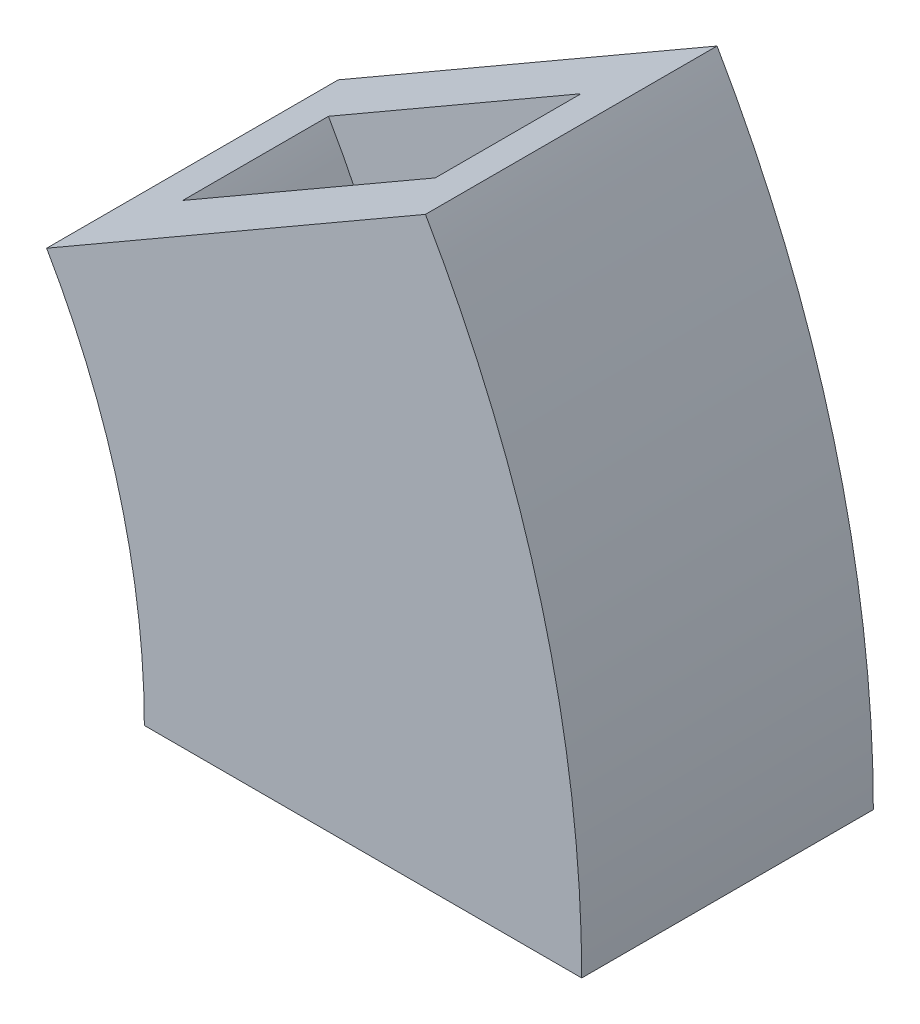
ISO-10303-21;
HEADER;
FILE_DESCRIPTION(('STEP AP214'),'2;1');
FILE_NAME('part.step','',(''),(''),'','','');
FILE_SCHEMA(('AUTOMOTIVE_DESIGN { 1 0 10303 214 1 1 1 1 }'));
ENDSEC;
DATA;
#1=APPLICATION_CONTEXT('core data for automotive mechanical design processes');
#2=APPLICATION_PROTOCOL_DEFINITION('international standard','automotive_design',2000,#1);
#3=PRODUCT_CONTEXT('',#1,'mechanical');
#4=PRODUCT('Part','Part','',(#3));
#5=PRODUCT_RELATED_PRODUCT_CATEGORY('part','',(#4));
#6=PRODUCT_DEFINITION_FORMATION('','',#4);
#7=PRODUCT_DEFINITION_CONTEXT('part definition',#1,'design');
#8=PRODUCT_DEFINITION('design','',#6,#7);
#9=PRODUCT_DEFINITION_SHAPE('','',#8);
#10=(LENGTH_UNIT() NAMED_UNIT(*) SI_UNIT(.MILLI.,.METRE.));
#11=(NAMED_UNIT(*) PLANE_ANGLE_UNIT() SI_UNIT($,.RADIAN.));
#12=(NAMED_UNIT(*) SI_UNIT($,.STERADIAN.) SOLID_ANGLE_UNIT());
#13=UNCERTAINTY_MEASURE_WITH_UNIT(LENGTH_MEASURE(1.E-05),#10,'distance_accuracy_value','');
#14=(GEOMETRIC_REPRESENTATION_CONTEXT(3) GLOBAL_UNCERTAINTY_ASSIGNED_CONTEXT((#13)) GLOBAL_UNIT_ASSIGNED_CONTEXT((#10,
#11,#12)) REPRESENTATION_CONTEXT('',''));
#15=CARTESIAN_POINT('',(0.,0.,0.));
#16=DIRECTION('',(0.,0.,1.));
#17=DIRECTION('',(1.,0.,0.));
#18=AXIS2_PLACEMENT_3D('',#15,#16,#17);
#19=CARTESIAN_POINT('',(-7.23758779701685,15.2483556476354,10.));
#20=DIRECTION('',(0.,0.,-1.));
#21=DIRECTION('',(-1.,0.,0.));
#22=AXIS2_PLACEMENT_3D('',#19,#20,#21);
#23=PLANE('',#22);
#24=CARTESIAN_POINT('',(-7.23758779701539,15.2483556476357,10.));
#25=DIRECTION('',(0.,0.,1.));
#26=DIRECTION('',(1.,0.,0.));
#27=AXIS2_PLACEMENT_3D('',#24,#25,#26);
#28=CIRCLE('',#27,75.);
#29=CARTESIAN_POINT('',(67.7624122029846,15.2483556476357,10.));
#30=VERTEX_POINT('',#29);
#31=CARTESIAN_POINT('',(57.7143174868177,52.7483556476354,10.));
#32=VERTEX_POINT('',#31);
#33=EDGE_CURVE('E57',#30,#32,#28,.T.);
#34=ORIENTED_EDGE('',*,*,#33,.F.);
#35=DIRECTION('',(1.,0.,0.));
#36=VECTOR('',#35,1.);
#37=CARTESIAN_POINT('',(42.7624122029846,15.2483556476357,10.));
#38=LINE('',#37,#36);
#39=CARTESIAN_POINT('',(47.7624122029846,15.2483556476357,10.));
#40=VERTEX_POINT('',#39);
#41=EDGE_CURVE('E164',#40,#30,#38,.T.);
#42=ORIENTED_EDGE('',*,*,#41,.F.);
#43=CARTESIAN_POINT('',(-7.23758779701539,15.2483556476357,10.));
#44=DIRECTION('',(0.,0.,1.));
#45=DIRECTION('',(1.,0.,0.));
#46=AXIS2_PLACEMENT_3D('',#43,#44,#45);
#47=CIRCLE('',#46,55.);
#48=CARTESIAN_POINT('',(40.3938094111289,42.7483556476355,10.));
#49=VERTEX_POINT('',#48);
#50=EDGE_CURVE('E65',#40,#49,#47,.T.);
#51=ORIENTED_EDGE('',*,*,#50,.T.);
#52=DIRECTION('',(-0.866025403784441,-0.499999999999995,0.));
#53=VECTOR('',#52,1.);
#54=CARTESIAN_POINT('',(36.0636823922067,40.2483556476355,10.));
#55=LINE('',#54,#53);
#56=EDGE_CURVE('E168',#32,#49,#55,.T.);
#57=ORIENTED_EDGE('',*,*,#56,.F.);
#58=EDGE_LOOP('',(#34,#42,#51,#57));
#59=FACE_BOUND('',#58,.T.);
#60=ADVANCED_FACE('F41',(#59),#23,.T.);
#61=CARTESIAN_POINT('',(0.,15.2483556476357,10.));
#62=DIRECTION('',(0.,1.,0.));
#63=DIRECTION('',(0.,0.,1.));
#64=AXIS2_PLACEMENT_3D('',#61,#62,#63);
#65=PLANE('',#64);
#66=DIRECTION('',(-1.,0.,0.));
#67=VECTOR('',#66,1.);
#68=CARTESIAN_POINT('',(42.7624122029846,15.2483556476354,0.));
#69=LINE('',#68,#67);
#70=CARTESIAN_POINT('',(67.7624122029846,15.2483556476357,0.));
#71=VERTEX_POINT('',#70);
#72=CARTESIAN_POINT('',(47.7624122029846,15.2483556476357,0.));
#73=VERTEX_POINT('',#72);
#74=EDGE_CURVE('E138',#71,#73,#69,.T.);
#75=ORIENTED_EDGE('',*,*,#74,.T.);
#76=DIRECTION('',(0.,0.,-1.));
#77=VECTOR('',#76,1.);
#78=CARTESIAN_POINT('',(47.7624122029846,15.2483556476357,10.));
#79=LINE('',#78,#77);
#80=EDGE_CURVE('E11',#40,#73,#79,.T.);
#81=ORIENTED_EDGE('',*,*,#80,.F.);
#82=ORIENTED_EDGE('',*,*,#41,.T.);
#83=DIRECTION('',(0.,0.,-1.));
#84=VECTOR('',#83,1.);
#85=CARTESIAN_POINT('',(67.7624122029846,15.2483556476357,10.));
#86=LINE('',#85,#84);
#87=EDGE_CURVE('E154',#30,#71,#86,.T.);
#88=ORIENTED_EDGE('',*,*,#87,.T.);
#89=EDGE_LOOP('',(#75,#81,#82,#88));
#90=FACE_BOUND('',#89,.T.);
#91=DIRECTION('',(0.,0.,-1.));
#92=VECTOR('',#91,1.);
#93=CARTESIAN_POINT('',(42.7624122029846,15.2483556476357,10.));
#94=LINE('',#93,#92);
#95=CARTESIAN_POINT('',(42.7624122029846,15.2483556476357,15.));
#96=VERTEX_POINT('',#95);
#97=CARTESIAN_POINT('',(42.7624122029846,15.2483556476354,-5.));
#98=VERTEX_POINT('',#97);
#99=EDGE_CURVE('E120',#96,#98,#94,.T.);
#100=ORIENTED_EDGE('',*,*,#99,.T.);
#101=DIRECTION('',(-1.,0.,0.));
#102=VECTOR('',#101,1.);
#103=CARTESIAN_POINT('',(42.7624122029846,15.2483556476354,-5.));
#104=LINE('',#103,#102);
#105=CARTESIAN_POINT('',(72.7624122029846,15.2483556476357,-5.));
#106=VERTEX_POINT('',#105);
#107=EDGE_CURVE('E136',#106,#98,#104,.T.);
#108=ORIENTED_EDGE('',*,*,#107,.F.);
#109=DIRECTION('',(0.,0.,-1.));
#110=VECTOR('',#109,1.);
#111=CARTESIAN_POINT('',(72.7624122029846,15.2483556476358,15.));
#112=LINE('',#111,#110);
#113=CARTESIAN_POINT('',(72.7624122029846,15.2483556476358,15.));
#114=VERTEX_POINT('',#113);
#115=EDGE_CURVE('E183',#114,#106,#112,.T.);
#116=ORIENTED_EDGE('',*,*,#115,.F.);
#117=DIRECTION('',(1.,0.,0.));
#118=VECTOR('',#117,1.);
#119=CARTESIAN_POINT('',(42.7624122029846,15.2483556476357,15.));
#120=LINE('',#119,#118);
#121=EDGE_CURVE('E167',#96,#114,#120,.T.);
#122=ORIENTED_EDGE('',*,*,#121,.F.);
#123=EDGE_LOOP('',(#100,#108,#116,#122));
#124=FACE_BOUND('',#123,.T.);
#125=ADVANCED_FACE('F43',(#90,#124),#65,.F.);
#126=CARTESIAN_POINT('',(-7.23758779701539,15.2483556476357,10.));
#127=DIRECTION('',(0.,0.,-1.));
#128=DIRECTION('',(-1.,0.,0.));
#129=AXIS2_PLACEMENT_3D('',#126,#127,#128);
#130=CYLINDRICAL_SURFACE('',#129,55.);
#131=CARTESIAN_POINT('',(-7.23758779701539,15.2483556476357,0.));
#132=DIRECTION('',(0.,0.,1.));
#133=DIRECTION('',(1.,0.,0.));
#134=AXIS2_PLACEMENT_3D('',#131,#132,#133);
#135=CIRCLE('',#134,55.);
#136=CARTESIAN_POINT('',(40.3938094111289,42.7483556476355,0.));
#137=VERTEX_POINT('',#136);
#138=EDGE_CURVE('E186',#73,#137,#135,.T.);
#139=ORIENTED_EDGE('',*,*,#138,.T.);
#140=DIRECTION('',(0.,0.,-1.));
#141=VECTOR('',#140,1.);
#142=CARTESIAN_POINT('',(40.3938094111289,42.7483556476355,10.));
#143=LINE('',#142,#141);
#144=EDGE_CURVE('E50',#49,#137,#143,.T.);
#145=ORIENTED_EDGE('',*,*,#144,.F.);
#146=ORIENTED_EDGE('',*,*,#50,.F.);
#147=ORIENTED_EDGE('',*,*,#80,.T.);
#148=EDGE_LOOP('',(#139,#145,#146,#147));
#149=FACE_BOUND('',#148,.T.);
#150=ADVANCED_FACE('F198',(#149),#130,.T.);
#151=CARTESIAN_POINT('',(-8.41212862765,14.5702341828946,10.));
#152=DIRECTION('',(-0.499999999999995,0.866025403784442,0.));
#153=DIRECTION('',(-0.866025403784442,-0.499999999999995,0.));
#154=AXIS2_PLACEMENT_3D('',#151,#152,#153);
#155=PLANE('',#154);
#156=ORIENTED_EDGE('',*,*,#144,.T.);
#157=DIRECTION('',(0.866025403784441,0.499999999999995,0.));
#158=VECTOR('',#157,1.);
#159=CARTESIAN_POINT('',(36.0636823922067,40.2483556476355,0.));
#160=LINE('',#159,#158);
#161=CARTESIAN_POINT('',(57.7143174868177,52.7483556476354,0.));
#162=VERTEX_POINT('',#161);
#163=EDGE_CURVE('E141',#137,#162,#160,.T.);
#164=ORIENTED_EDGE('',*,*,#163,.T.);
#165=DIRECTION('',(0.,0.,-1.));
#166=VECTOR('',#165,1.);
#167=CARTESIAN_POINT('',(57.7143174868177,52.7483556476354,10.));
#168=LINE('',#167,#166);
#169=EDGE_CURVE('E160',#32,#162,#168,.T.);
#170=ORIENTED_EDGE('',*,*,#169,.F.);
#171=ORIENTED_EDGE('',*,*,#56,.T.);
#172=EDGE_LOOP('',(#156,#164,#170,#171));
#173=FACE_BOUND('',#172,.T.);
#174=DIRECTION('',(0.866025403784441,0.499999999999995,0.));
#175=VECTOR('',#174,1.);
#176=CARTESIAN_POINT('',(36.0636823922067,40.2483556476355,-5.));
#177=LINE('',#176,#175);
#178=CARTESIAN_POINT('',(36.0636823922067,40.2483556476355,-5.));
#179=VERTEX_POINT('',#178);
#180=CARTESIAN_POINT('',(62.0444445057399,55.2483556476353,-5.));
#181=VERTEX_POINT('',#180);
#182=EDGE_CURVE('E123',#179,#181,#177,.T.);
#183=ORIENTED_EDGE('',*,*,#182,.F.);
#184=DIRECTION('',(0.,0.,-1.));
#185=VECTOR('',#184,1.);
#186=CARTESIAN_POINT('',(36.0636823922067,40.2483556476355,10.));
#187=LINE('',#186,#185);
#188=CARTESIAN_POINT('',(36.0636823922067,40.2483556476355,15.));
#189=VERTEX_POINT('',#188);
#190=EDGE_CURVE('E109',#189,#179,#187,.T.);
#191=ORIENTED_EDGE('',*,*,#190,.F.);
#192=DIRECTION('',(-0.866025403784441,-0.499999999999995,0.));
#193=VECTOR('',#192,1.);
#194=CARTESIAN_POINT('',(36.0636823922067,40.2483556476355,15.));
#195=LINE('',#194,#193);
#196=CARTESIAN_POINT('',(62.0444445057399,55.2483556476353,15.));
#197=VERTEX_POINT('',#196);
#198=EDGE_CURVE('E174',#197,#189,#195,.T.);
#199=ORIENTED_EDGE('',*,*,#198,.F.);
#200=DIRECTION('',(0.,0.,-1.));
#201=VECTOR('',#200,1.);
#202=CARTESIAN_POINT('',(62.0444445057399,55.2483556476353,15.));
#203=LINE('',#202,#201);
#204=EDGE_CURVE('E126',#197,#181,#203,.T.);
#205=ORIENTED_EDGE('',*,*,#204,.T.);
#206=EDGE_LOOP('',(#183,#191,#199,#205));
#207=FACE_BOUND('',#206,.T.);
#208=ADVANCED_FACE('F124',(#173,#207),#155,.T.);
#209=CARTESIAN_POINT('',(-7.23758779701539,15.2483556476357,10.));
#210=DIRECTION('',(0.,0.,-1.));
#211=DIRECTION('',(-1.,0.,0.));
#212=AXIS2_PLACEMENT_3D('',#209,#210,#211);
#213=CYLINDRICAL_SURFACE('',#212,50.);
#214=ORIENTED_EDGE('',*,*,#190,.T.);
#215=CARTESIAN_POINT('',(-7.23758779701705,15.2483556476353,-5.));
#216=DIRECTION('',(0.,0.,1.));
#217=DIRECTION('',(-1.,0.,0.));
#218=AXIS2_PLACEMENT_3D('',#215,#216,#217);
#219=CIRCLE('',#218,50.0000000000017);
#220=EDGE_CURVE('E113',#98,#179,#219,.T.);
#221=ORIENTED_EDGE('',*,*,#220,.F.);
#222=ORIENTED_EDGE('',*,*,#99,.F.);
#223=CARTESIAN_POINT('',(-7.23758779701685,15.2483556476354,15.));
#224=DIRECTION('',(0.,0.,-1.));
#225=DIRECTION('',(-1.,0.,0.));
#226=AXIS2_PLACEMENT_3D('',#223,#224,#225);
#227=CIRCLE('',#226,50.0000000000015);
#228=EDGE_CURVE('E115',#189,#96,#227,.T.);
#229=ORIENTED_EDGE('',*,*,#228,.F.);
#230=EDGE_LOOP('',(#214,#221,#222,#229));
#231=FACE_BOUND('',#230,.T.);
#232=ADVANCED_FACE('F111',(#231),#213,.F.);
#233=CARTESIAN_POINT('',(-7.23758779701708,15.2483556476353,15.));
#234=DIRECTION('',(0.,0.,-1.));
#235=DIRECTION('',(-1.,0.,0.));
#236=AXIS2_PLACEMENT_3D('',#233,#234,#235);
#237=CYLINDRICAL_SURFACE('',#236,80.0000000000017);
#238=ORIENTED_EDGE('',*,*,#115,.T.);
#239=CARTESIAN_POINT('',(-7.23758779701666,15.2483556476354,-5.));
#240=DIRECTION('',(0.,0.,-1.));
#241=DIRECTION('',(1.,0.,0.));
#242=AXIS2_PLACEMENT_3D('',#239,#240,#241);
#243=CIRCLE('',#242,80.0000000000013);
#244=EDGE_CURVE('E131',#181,#106,#243,.T.);
#245=ORIENTED_EDGE('',*,*,#244,.F.);
#246=ORIENTED_EDGE('',*,*,#204,.F.);
#247=CARTESIAN_POINT('',(-7.23758779701708,15.2483556476353,15.));
#248=DIRECTION('',(0.,0.,1.));
#249=DIRECTION('',(-1.,0.,0.));
#250=AXIS2_PLACEMENT_3D('',#247,#248,#249);
#251=CIRCLE('',#250,80.0000000000017);
#252=EDGE_CURVE('E171',#114,#197,#251,.T.);
#253=ORIENTED_EDGE('',*,*,#252,.F.);
#254=EDGE_LOOP('',(#238,#245,#246,#253));
#255=FACE_BOUND('',#254,.T.);
#256=ADVANCED_FACE('F216',(#255),#237,.T.);
#257=CARTESIAN_POINT('',(-7.23758779701685,15.2483556476354,15.));
#258=DIRECTION('',(0.,0.,-1.));
#259=DIRECTION('',(-1.,0.,0.));
#260=AXIS2_PLACEMENT_3D('',#257,#258,#259);
#261=PLANE('',#260);
#262=ORIENTED_EDGE('',*,*,#228,.T.);
#263=ORIENTED_EDGE('',*,*,#121,.T.);
#264=ORIENTED_EDGE('',*,*,#252,.T.);
#265=ORIENTED_EDGE('',*,*,#198,.T.);
#266=EDGE_LOOP('',(#262,#263,#264,#265));
#267=FACE_BOUND('',#266,.T.);
#268=ADVANCED_FACE('F214',(#267),#261,.F.);
#269=CARTESIAN_POINT('',(-7.23758779701539,15.2483556476357,10.));
#270=DIRECTION('',(0.,0.,-1.));
#271=DIRECTION('',(-1.,0.,0.));
#272=AXIS2_PLACEMENT_3D('',#269,#270,#271);
#273=CYLINDRICAL_SURFACE('',#272,75.);
#274=CARTESIAN_POINT('',(-7.23758779701539,15.2483556476357,0.));
#275=DIRECTION('',(0.,0.,1.));
#276=DIRECTION('',(1.,0.,0.));
#277=AXIS2_PLACEMENT_3D('',#274,#275,#276);
#278=CIRCLE('',#277,75.);
#279=EDGE_CURVE('E148',#71,#162,#278,.T.);
#280=ORIENTED_EDGE('',*,*,#279,.F.);
#281=ORIENTED_EDGE('',*,*,#87,.F.);
#282=ORIENTED_EDGE('',*,*,#33,.T.);
#283=ORIENTED_EDGE('',*,*,#169,.T.);
#284=EDGE_LOOP('',(#280,#281,#282,#283));
#285=FACE_BOUND('',#284,.T.);
#286=ADVANCED_FACE('F204',(#285),#273,.F.);
#287=CARTESIAN_POINT('',(-7.23758779701705,15.2483556476353,0.));
#288=DIRECTION('',(0.,0.,-1.));
#289=DIRECTION('',(-1.,0.,0.));
#290=AXIS2_PLACEMENT_3D('',#287,#288,#289);
#291=PLANE('',#290);
#292=ORIENTED_EDGE('',*,*,#163,.F.);
#293=ORIENTED_EDGE('',*,*,#138,.F.);
#294=ORIENTED_EDGE('',*,*,#74,.F.);
#295=ORIENTED_EDGE('',*,*,#279,.T.);
#296=EDGE_LOOP('',(#292,#293,#294,#295));
#297=FACE_BOUND('',#296,.T.);
#298=ADVANCED_FACE('F200',(#297),#291,.F.);
#299=CARTESIAN_POINT('',(-7.23758779701705,15.2483556476353,-5.));
#300=DIRECTION('',(0.,0.,-1.));
#301=DIRECTION('',(-1.,0.,0.));
#302=AXIS2_PLACEMENT_3D('',#299,#300,#301);
#303=PLANE('',#302);
#304=ORIENTED_EDGE('',*,*,#220,.T.);
#305=ORIENTED_EDGE('',*,*,#182,.T.);
#306=ORIENTED_EDGE('',*,*,#244,.T.);
#307=ORIENTED_EDGE('',*,*,#107,.T.);
#308=EDGE_LOOP('',(#304,#305,#306,#307));
#309=FACE_BOUND('',#308,.T.);
#310=ADVANCED_FACE('F134',(#309),#303,.T.);
#311=CLOSED_SHELL('',(#60,#125,#150,#208,#232,#256,#268,#286,#298,#310));
#312=MANIFOLD_SOLID_BREP('B2',#311);
#313=ADVANCED_BREP_SHAPE_REPRESENTATION('',(#18,#312),#14);
#314=SHAPE_DEFINITION_REPRESENTATION(#9,#313);
ENDSEC;
END-ISO-10303-21;
